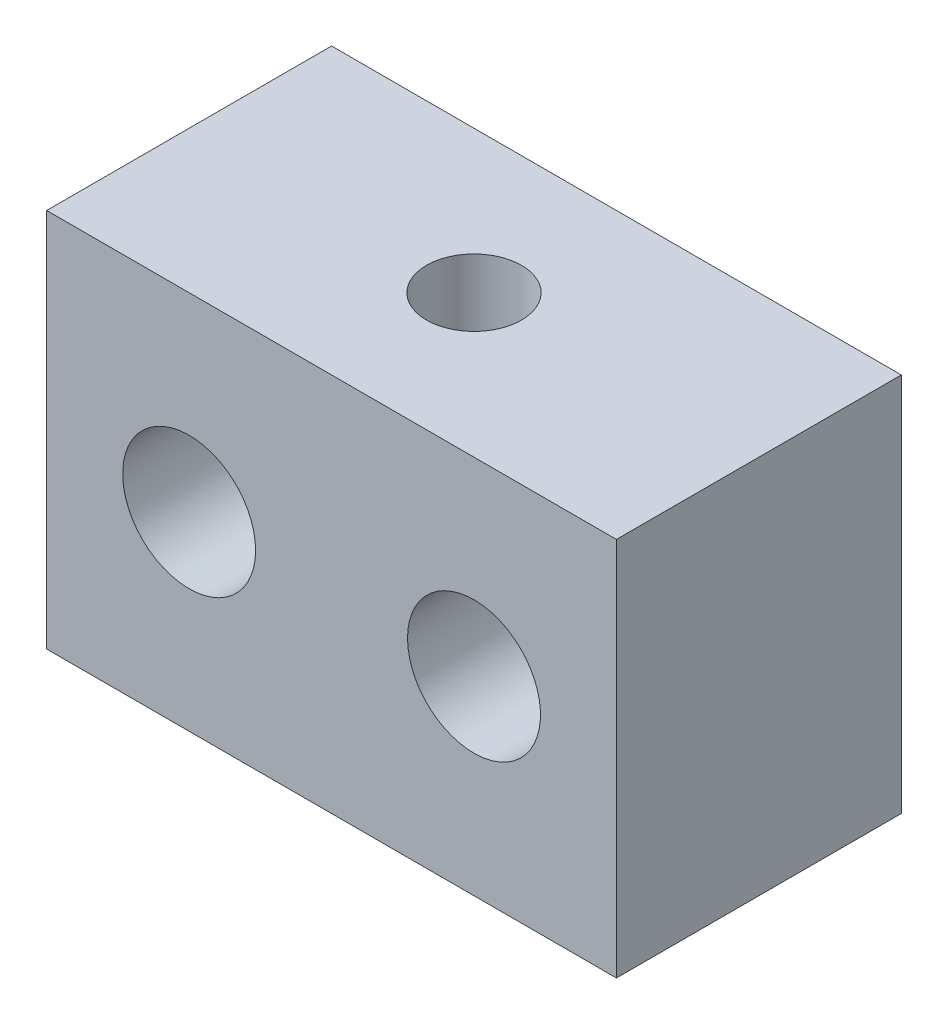
ISO-10303-21;
HEADER;
FILE_DESCRIPTION(('STEP AP214'),'2;1');
FILE_NAME('part.step','',(''),(''),'','','');
FILE_SCHEMA(('AUTOMOTIVE_DESIGN { 1 0 10303 214 1 1 1 1 }'));
ENDSEC;
DATA;
#1=APPLICATION_CONTEXT('core data for automotive mechanical design processes');
#2=APPLICATION_PROTOCOL_DEFINITION('international standard','automotive_design',2000,#1);
#3=PRODUCT_CONTEXT('',#1,'mechanical');
#4=PRODUCT('Part','Part','',(#3));
#5=PRODUCT_RELATED_PRODUCT_CATEGORY('part','',(#4));
#6=PRODUCT_DEFINITION_FORMATION('','',#4);
#7=PRODUCT_DEFINITION_CONTEXT('part definition',#1,'design');
#8=PRODUCT_DEFINITION('design','',#6,#7);
#9=PRODUCT_DEFINITION_SHAPE('','',#8);
#10=(LENGTH_UNIT() NAMED_UNIT(*) SI_UNIT(.MILLI.,.METRE.));
#11=(NAMED_UNIT(*) PLANE_ANGLE_UNIT() SI_UNIT($,.RADIAN.));
#12=(NAMED_UNIT(*) SI_UNIT($,.STERADIAN.) SOLID_ANGLE_UNIT());
#13=UNCERTAINTY_MEASURE_WITH_UNIT(LENGTH_MEASURE(1.E-05),#10,'distance_accuracy_value','');
#14=(GEOMETRIC_REPRESENTATION_CONTEXT(3) GLOBAL_UNCERTAINTY_ASSIGNED_CONTEXT((#13)) GLOBAL_UNIT_ASSIGNED_CONTEXT((#10,
#11,#12)) REPRESENTATION_CONTEXT('',''));
#15=CARTESIAN_POINT('',(0.,0.,0.));
#16=DIRECTION('',(0.,0.,1.));
#17=DIRECTION('',(1.,0.,0.));
#18=AXIS2_PLACEMENT_3D('',#15,#16,#17);
#19=CARTESIAN_POINT('',(0.,0.,15.));
#20=DIRECTION('',(0.,0.,1.));
#21=DIRECTION('',(1.,0.,0.));
#22=AXIS2_PLACEMENT_3D('',#19,#20,#21);
#23=PLANE('',#22);
#24=CARTESIAN_POINT('',(-7.5,0.,15.));
#25=DIRECTION('',(0.,0.,1.));
#26=DIRECTION('',(1.,0.,0.));
#27=AXIS2_PLACEMENT_3D('',#24,#25,#26);
#28=CIRCLE('',#27,3.5);
#29=CARTESIAN_POINT('',(-4.,0.,15.));
#30=VERTEX_POINT('',#29);
#31=EDGE_CURVE('E115',#30,#30,#28,.T.);
#32=ORIENTED_EDGE('',*,*,#31,.F.);
#33=EDGE_LOOP('',(#32));
#34=FACE_BOUND('',#33,.T.);
#35=DIRECTION('',(0.,1.,0.));
#36=VECTOR('',#35,1.);
#37=CARTESIAN_POINT('',(15.,10.,15.));
#38=LINE('',#37,#36);
#39=CARTESIAN_POINT('',(15.,-10.,15.));
#40=VERTEX_POINT('',#39);
#41=CARTESIAN_POINT('',(15.,10.,15.));
#42=VERTEX_POINT('',#41);
#43=EDGE_CURVE('E121',#40,#42,#38,.T.);
#44=ORIENTED_EDGE('',*,*,#43,.T.);
#45=DIRECTION('',(-1.,0.,0.));
#46=VECTOR('',#45,1.);
#47=CARTESIAN_POINT('',(-15.,10.,15.));
#48=LINE('',#47,#46);
#49=CARTESIAN_POINT('',(-15.,10.,15.));
#50=VERTEX_POINT('',#49);
#51=EDGE_CURVE('E89',#42,#50,#48,.T.);
#52=ORIENTED_EDGE('',*,*,#51,.T.);
#53=DIRECTION('',(0.,-1.,0.));
#54=VECTOR('',#53,1.);
#55=CARTESIAN_POINT('',(-15.,10.,15.));
#56=LINE('',#55,#54);
#57=CARTESIAN_POINT('',(-15.,-10.,15.));
#58=VERTEX_POINT('',#57);
#59=EDGE_CURVE('E124',#50,#58,#56,.T.);
#60=ORIENTED_EDGE('',*,*,#59,.T.);
#61=DIRECTION('',(1.,0.,0.));
#62=VECTOR('',#61,1.);
#63=CARTESIAN_POINT('',(-15.,-10.,15.));
#64=LINE('',#63,#62);
#65=EDGE_CURVE('E58',#58,#40,#64,.T.);
#66=ORIENTED_EDGE('',*,*,#65,.T.);
#67=EDGE_LOOP('',(#44,#52,#60,#66));
#68=FACE_BOUND('',#67,.T.);
#69=CARTESIAN_POINT('',(7.5,0.,15.));
#70=DIRECTION('',(0.,0.,1.));
#71=DIRECTION('',(-1.,0.,0.));
#72=AXIS2_PLACEMENT_3D('',#69,#70,#71);
#73=CIRCLE('',#72,3.5);
#74=CARTESIAN_POINT('',(4.,0.,15.));
#75=VERTEX_POINT('',#74);
#76=EDGE_CURVE('E107',#75,#75,#73,.T.);
#77=ORIENTED_EDGE('',*,*,#76,.F.);
#78=EDGE_LOOP('',(#77));
#79=FACE_BOUND('',#78,.T.);
#80=ADVANCED_FACE('F41',(#34,#68,#79),#23,.T.);
#81=CARTESIAN_POINT('',(0.,0.,0.));
#82=DIRECTION('',(0.,0.,1.));
#83=DIRECTION('',(1.,0.,0.));
#84=AXIS2_PLACEMENT_3D('',#81,#82,#83);
#85=PLANE('',#84);
#86=DIRECTION('',(0.,1.,0.));
#87=VECTOR('',#86,1.);
#88=CARTESIAN_POINT('',(15.,10.,0.));
#89=LINE('',#88,#87);
#90=CARTESIAN_POINT('',(15.,-10.,0.));
#91=VERTEX_POINT('',#90);
#92=CARTESIAN_POINT('',(15.,10.,0.));
#93=VERTEX_POINT('',#92);
#94=EDGE_CURVE('E118',#91,#93,#89,.T.);
#95=ORIENTED_EDGE('',*,*,#94,.F.);
#96=DIRECTION('',(1.,0.,0.));
#97=VECTOR('',#96,1.);
#98=CARTESIAN_POINT('',(-15.,-10.,0.));
#99=LINE('',#98,#97);
#100=CARTESIAN_POINT('',(-15.,-10.,0.));
#101=VERTEX_POINT('',#100);
#102=EDGE_CURVE('E82',#101,#91,#99,.T.);
#103=ORIENTED_EDGE('',*,*,#102,.F.);
#104=DIRECTION('',(0.,-1.,0.));
#105=VECTOR('',#104,1.);
#106=CARTESIAN_POINT('',(-15.,10.,0.));
#107=LINE('',#106,#105);
#108=CARTESIAN_POINT('',(-15.,10.,0.));
#109=VERTEX_POINT('',#108);
#110=EDGE_CURVE('E76',#109,#101,#107,.T.);
#111=ORIENTED_EDGE('',*,*,#110,.F.);
#112=DIRECTION('',(-1.,0.,0.));
#113=VECTOR('',#112,1.);
#114=CARTESIAN_POINT('',(-15.,10.,0.));
#115=LINE('',#114,#113);
#116=EDGE_CURVE('E130',#93,#109,#115,.T.);
#117=ORIENTED_EDGE('',*,*,#116,.F.);
#118=EDGE_LOOP('',(#95,#103,#111,#117));
#119=FACE_BOUND('',#118,.T.);
#120=CARTESIAN_POINT('',(-7.5,0.,0.));
#121=DIRECTION('',(0.,0.,1.));
#122=DIRECTION('',(1.,0.,0.));
#123=AXIS2_PLACEMENT_3D('',#120,#121,#122);
#124=CIRCLE('',#123,3.5);
#125=CARTESIAN_POINT('',(-4.,0.,0.));
#126=VERTEX_POINT('',#125);
#127=EDGE_CURVE('E113',#126,#126,#124,.T.);
#128=ORIENTED_EDGE('',*,*,#127,.T.);
#129=EDGE_LOOP('',(#128));
#130=FACE_BOUND('',#129,.T.);
#131=CARTESIAN_POINT('',(7.5,0.,0.));
#132=DIRECTION('',(0.,0.,1.));
#133=DIRECTION('',(-1.,0.,0.));
#134=AXIS2_PLACEMENT_3D('',#131,#132,#133);
#135=CIRCLE('',#134,3.5);
#136=CARTESIAN_POINT('',(4.,0.,0.));
#137=VERTEX_POINT('',#136);
#138=EDGE_CURVE('E103',#137,#137,#135,.T.);
#139=ORIENTED_EDGE('',*,*,#138,.T.);
#140=EDGE_LOOP('',(#139));
#141=FACE_BOUND('',#140,.T.);
#142=ADVANCED_FACE('F140',(#119,#130,#141),#85,.F.);
#143=CARTESIAN_POINT('',(15.,10.,15.));
#144=DIRECTION('',(-1.,0.,0.));
#145=DIRECTION('',(0.,0.,1.));
#146=AXIS2_PLACEMENT_3D('',#143,#144,#145);
#147=PLANE('',#146);
#148=ORIENTED_EDGE('',*,*,#94,.T.);
#149=DIRECTION('',(0.,0.,-1.));
#150=VECTOR('',#149,1.);
#151=CARTESIAN_POINT('',(15.,10.,15.));
#152=LINE('',#151,#150);
#153=EDGE_CURVE('E11',#42,#93,#152,.T.);
#154=ORIENTED_EDGE('',*,*,#153,.F.);
#155=ORIENTED_EDGE('',*,*,#43,.F.);
#156=DIRECTION('',(0.,0.,-1.));
#157=VECTOR('',#156,1.);
#158=CARTESIAN_POINT('',(15.,-10.,15.));
#159=LINE('',#158,#157);
#160=EDGE_CURVE('E127',#40,#91,#159,.T.);
#161=ORIENTED_EDGE('',*,*,#160,.T.);
#162=EDGE_LOOP('',(#148,#154,#155,#161));
#163=FACE_BOUND('',#162,.T.);
#164=ADVANCED_FACE('F43',(#163),#147,.F.);
#165=CARTESIAN_POINT('',(-15.,10.,15.));
#166=DIRECTION('',(0.,-1.,0.));
#167=DIRECTION('',(0.,0.,-1.));
#168=AXIS2_PLACEMENT_3D('',#165,#166,#167);
#169=PLANE('',#168);
#170=CARTESIAN_POINT('',(0.,10.,7.5));
#171=DIRECTION('',(0.,1.,0.));
#172=DIRECTION('',(0.,0.,1.));
#173=AXIS2_PLACEMENT_3D('',#170,#171,#172);
#174=CIRCLE('',#173,2.49999999999999);
#175=CARTESIAN_POINT('',(0.,10.,9.99999999999999));
#176=VERTEX_POINT('',#175);
#177=EDGE_CURVE('E104',#176,#176,#174,.T.);
#178=ORIENTED_EDGE('',*,*,#177,.F.);
#179=EDGE_LOOP('',(#178));
#180=FACE_BOUND('',#179,.T.);
#181=ORIENTED_EDGE('',*,*,#116,.T.);
#182=DIRECTION('',(0.,0.,-1.));
#183=VECTOR('',#182,1.);
#184=CARTESIAN_POINT('',(-15.,10.,15.));
#185=LINE('',#184,#183);
#186=EDGE_CURVE('E50',#50,#109,#185,.T.);
#187=ORIENTED_EDGE('',*,*,#186,.F.);
#188=ORIENTED_EDGE('',*,*,#51,.F.);
#189=ORIENTED_EDGE('',*,*,#153,.T.);
#190=EDGE_LOOP('',(#181,#187,#188,#189));
#191=FACE_BOUND('',#190,.T.);
#192=ADVANCED_FACE('F155',(#180,#191),#169,.F.);
#193=CARTESIAN_POINT('',(-15.,10.,15.));
#194=DIRECTION('',(1.,0.,0.));
#195=DIRECTION('',(0.,1.,0.));
#196=AXIS2_PLACEMENT_3D('',#193,#194,#195);
#197=PLANE('',#196);
#198=ORIENTED_EDGE('',*,*,#110,.T.);
#199=DIRECTION('',(0.,0.,-1.));
#200=VECTOR('',#199,1.);
#201=CARTESIAN_POINT('',(-15.,-10.,15.));
#202=LINE('',#201,#200);
#203=EDGE_CURVE('E135',#58,#101,#202,.T.);
#204=ORIENTED_EDGE('',*,*,#203,.F.);
#205=ORIENTED_EDGE('',*,*,#59,.F.);
#206=ORIENTED_EDGE('',*,*,#186,.T.);
#207=EDGE_LOOP('',(#198,#204,#205,#206));
#208=FACE_BOUND('',#207,.T.);
#209=ADVANCED_FACE('F137',(#208),#197,.F.);
#210=CARTESIAN_POINT('',(-15.,-10.,15.));
#211=DIRECTION('',(0.,1.,0.));
#212=DIRECTION('',(-1.,0.,0.));
#213=AXIS2_PLACEMENT_3D('',#210,#211,#212);
#214=PLANE('',#213);
#215=ORIENTED_EDGE('',*,*,#102,.T.);
#216=ORIENTED_EDGE('',*,*,#160,.F.);
#217=ORIENTED_EDGE('',*,*,#65,.F.);
#218=ORIENTED_EDGE('',*,*,#203,.T.);
#219=EDGE_LOOP('',(#215,#216,#217,#218));
#220=FACE_BOUND('',#219,.T.);
#221=ADVANCED_FACE('F145',(#220),#214,.F.);
#222=CARTESIAN_POINT('',(-7.5,0.,15.));
#223=DIRECTION('',(0.,0.,-1.));
#224=DIRECTION('',(-1.,0.,0.));
#225=AXIS2_PLACEMENT_3D('',#222,#223,#224);
#226=CYLINDRICAL_SURFACE('',#225,3.5);
#227=ORIENTED_EDGE('',*,*,#31,.T.);
#228=EDGE_LOOP('',(#227));
#229=FACE_BOUND('',#228,.T.);
#230=ORIENTED_EDGE('',*,*,#127,.F.);
#231=EDGE_LOOP('',(#230));
#232=FACE_BOUND('',#231,.T.);
#233=ADVANCED_FACE('F147',(#229,#232),#226,.F.);
#234=CARTESIAN_POINT('',(7.5,0.,15.));
#235=DIRECTION('',(0.,0.,-1.));
#236=DIRECTION('',(-1.,0.,0.));
#237=AXIS2_PLACEMENT_3D('',#234,#235,#236);
#238=CYLINDRICAL_SURFACE('',#237,3.5);
#239=ORIENTED_EDGE('',*,*,#76,.T.);
#240=EDGE_LOOP('',(#239));
#241=FACE_BOUND('',#240,.T.);
#242=ORIENTED_EDGE('',*,*,#138,.F.);
#243=EDGE_LOOP('',(#242));
#244=FACE_BOUND('',#243,.T.);
#245=ADVANCED_FACE('F97',(#241,#244),#238,.F.);
#246=CARTESIAN_POINT('',(0.,-5.,7.5));
#247=DIRECTION('',(0.,1.,0.));
#248=DIRECTION('',(0.,0.,1.));
#249=AXIS2_PLACEMENT_3D('',#246,#247,#248);
#250=CONICAL_SURFACE('',#249,2.49999999999999,1.02974425867665);
#251=CARTESIAN_POINT('',(0.,-6.5021515475689,7.5));
#252=VERTEX_POINT('',#251);
#253=VERTEX_LOOP('',#252);
#254=FACE_BOUND('',#253,.T.);
#255=CARTESIAN_POINT('',(0.,-5.,7.5));
#256=DIRECTION('',(0.,1.,0.));
#257=DIRECTION('',(0.,0.,1.));
#258=AXIS2_PLACEMENT_3D('',#255,#256,#257);
#259=CIRCLE('',#258,2.49999999999999);
#260=CARTESIAN_POINT('',(0.,-5.,9.99999999999999));
#261=VERTEX_POINT('',#260);
#262=EDGE_CURVE('E101',#261,#261,#259,.T.);
#263=ORIENTED_EDGE('',*,*,#262,.T.);
#264=EDGE_LOOP('',(#263));
#265=FACE_BOUND('',#264,.T.);
#266=ADVANCED_FACE('F93',(#254,#265),#250,.F.);
#267=CARTESIAN_POINT('',(0.,10.,7.5));
#268=DIRECTION('',(0.,1.,0.));
#269=DIRECTION('',(0.,0.,1.));
#270=AXIS2_PLACEMENT_3D('',#267,#268,#269);
#271=CYLINDRICAL_SURFACE('',#270,2.49999999999999);
#272=ORIENTED_EDGE('',*,*,#262,.F.);
#273=EDGE_LOOP('',(#272));
#274=FACE_BOUND('',#273,.T.);
#275=ORIENTED_EDGE('',*,*,#177,.T.);
#276=EDGE_LOOP('',(#275));
#277=FACE_BOUND('',#276,.T.);
#278=ADVANCED_FACE('F96',(#274,#277),#271,.F.);
#279=CLOSED_SHELL('',(#80,#142,#164,#192,#209,#221,#233,#245,#266,#278));
#280=MANIFOLD_SOLID_BREP('B2',#279);
#281=ADVANCED_BREP_SHAPE_REPRESENTATION('',(#18,#280),#14);
#282=SHAPE_DEFINITION_REPRESENTATION(#9,#281);
ENDSEC;
END-ISO-10303-21;
